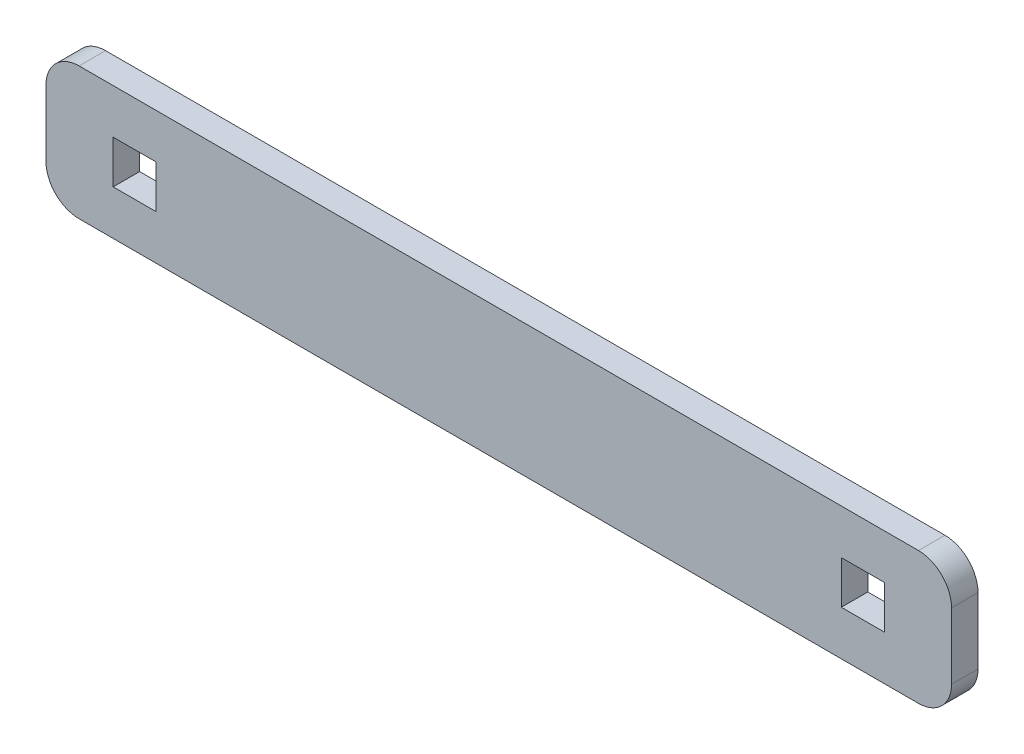
ISO-10303-21;
HEADER;
FILE_DESCRIPTION(('STEP AP214'),'2;1');
FILE_NAME('part.step','',(''),(''),'','','');
FILE_SCHEMA(('AUTOMOTIVE_DESIGN { 1 0 10303 214 1 1 1 1 }'));
ENDSEC;
DATA;
#1=APPLICATION_CONTEXT('core data for automotive mechanical design processes');
#2=APPLICATION_PROTOCOL_DEFINITION('international standard','automotive_design',2000,#1);
#3=PRODUCT_CONTEXT('',#1,'mechanical');
#4=PRODUCT('Part','Part','',(#3));
#5=PRODUCT_RELATED_PRODUCT_CATEGORY('part','',(#4));
#6=PRODUCT_DEFINITION_FORMATION('','',#4);
#7=PRODUCT_DEFINITION_CONTEXT('part definition',#1,'design');
#8=PRODUCT_DEFINITION('design','',#6,#7);
#9=PRODUCT_DEFINITION_SHAPE('','',#8);
#10=(LENGTH_UNIT() NAMED_UNIT(*) SI_UNIT(.MILLI.,.METRE.));
#11=(NAMED_UNIT(*) PLANE_ANGLE_UNIT() SI_UNIT($,.RADIAN.));
#12=(NAMED_UNIT(*) SI_UNIT($,.STERADIAN.) SOLID_ANGLE_UNIT());
#13=UNCERTAINTY_MEASURE_WITH_UNIT(LENGTH_MEASURE(1.E-05),#10,'distance_accuracy_value','');
#14=(GEOMETRIC_REPRESENTATION_CONTEXT(3) GLOBAL_UNCERTAINTY_ASSIGNED_CONTEXT((#13)) GLOBAL_UNIT_ASSIGNED_CONTEXT((#10,
#11,#12)) REPRESENTATION_CONTEXT('',''));
#15=CARTESIAN_POINT('',(0.,0.,0.));
#16=DIRECTION('',(0.,0.,1.));
#17=DIRECTION('',(1.,0.,0.));
#18=AXIS2_PLACEMENT_3D('',#15,#16,#17);
#19=CARTESIAN_POINT('',(-68.4,-10.,-4.));
#20=DIRECTION('',(-1.,0.,0.));
#21=DIRECTION('',(0.,-1.,0.));
#22=AXIS2_PLACEMENT_3D('',#19,#20,#21);
#23=PLANE('',#22);
#24=DIRECTION('',(0.,-1.,0.));
#25=VECTOR('',#24,1.);
#26=CARTESIAN_POINT('',(-68.4,-10.,-4.));
#27=LINE('',#26,#25);
#28=CARTESIAN_POINT('',(-68.4,5.,-4.));
#29=VERTEX_POINT('',#28);
#30=CARTESIAN_POINT('',(-68.4,-5.,-4.));
#31=VERTEX_POINT('',#30);
#32=EDGE_CURVE('E255',#29,#31,#27,.T.);
#33=ORIENTED_EDGE('',*,*,#32,.T.);
#34=DIRECTION('',(0.,0.,1.));
#35=VECTOR('',#34,1.);
#36=CARTESIAN_POINT('',(-68.4,-5.,-4.));
#37=LINE('',#36,#35);
#38=CARTESIAN_POINT('',(-68.4,-5.,0.));
#39=VERTEX_POINT('',#38);
#40=EDGE_CURVE('E288',#31,#39,#37,.T.);
#41=ORIENTED_EDGE('',*,*,#40,.T.);
#42=DIRECTION('',(0.,-1.,0.));
#43=VECTOR('',#42,1.);
#44=CARTESIAN_POINT('',(-68.4,-10.,0.));
#45=LINE('',#44,#43);
#46=CARTESIAN_POINT('',(-68.4,5.,0.));
#47=VERTEX_POINT('',#46);
#48=EDGE_CURVE('E245',#47,#39,#45,.T.);
#49=ORIENTED_EDGE('',*,*,#48,.F.);
#50=DIRECTION('',(0.,0.,1.));
#51=VECTOR('',#50,1.);
#52=CARTESIAN_POINT('',(-68.4,5.,-4.));
#53=LINE('',#52,#51);
#54=EDGE_CURVE('E271',#47,#29,#53,.F.);
#55=ORIENTED_EDGE('',*,*,#54,.T.);
#56=EDGE_LOOP('',(#33,#41,#49,#55));
#57=FACE_BOUND('',#56,.T.);
#58=ADVANCED_FACE('F40',(#57),#23,.T.);
#59=CARTESIAN_POINT('',(68.4,10.,-4.));
#60=DIRECTION('',(0.,1.,0.));
#61=DIRECTION('',(0.,0.,1.));
#62=AXIS2_PLACEMENT_3D('',#59,#60,#61);
#63=PLANE('',#62);
#64=DIRECTION('',(-1.,0.,0.));
#65=VECTOR('',#64,1.);
#66=CARTESIAN_POINT('',(68.4,10.,-4.));
#67=LINE('',#66,#65);
#68=CARTESIAN_POINT('',(63.4,10.,-4.));
#69=VERTEX_POINT('',#68);
#70=CARTESIAN_POINT('',(-63.4,10.,-4.));
#71=VERTEX_POINT('',#70);
#72=EDGE_CURVE('E267',#69,#71,#67,.T.);
#73=ORIENTED_EDGE('',*,*,#72,.T.);
#74=DIRECTION('',(0.,0.,1.));
#75=VECTOR('',#74,1.);
#76=CARTESIAN_POINT('',(-63.4,10.,-4.));
#77=LINE('',#76,#75);
#78=CARTESIAN_POINT('',(-63.4,10.,0.));
#79=VERTEX_POINT('',#78);
#80=EDGE_CURVE('E325',#71,#79,#77,.T.);
#81=ORIENTED_EDGE('',*,*,#80,.T.);
#82=DIRECTION('',(-1.,0.,0.));
#83=VECTOR('',#82,1.);
#84=CARTESIAN_POINT('',(68.4,10.,0.));
#85=LINE('',#84,#83);
#86=CARTESIAN_POINT('',(63.4,10.,0.));
#87=VERTEX_POINT('',#86);
#88=EDGE_CURVE('E260',#87,#79,#85,.T.);
#89=ORIENTED_EDGE('',*,*,#88,.F.);
#90=DIRECTION('',(0.,0.,1.));
#91=VECTOR('',#90,1.);
#92=CARTESIAN_POINT('',(63.4,10.,-4.));
#93=LINE('',#92,#91);
#94=EDGE_CURVE('E322',#87,#69,#93,.F.);
#95=ORIENTED_EDGE('',*,*,#94,.T.);
#96=EDGE_LOOP('',(#73,#81,#89,#95));
#97=FACE_BOUND('',#96,.T.);
#98=ADVANCED_FACE('F359',(#97),#63,.T.);
#99=CARTESIAN_POINT('',(68.4,-10.,-4.));
#100=DIRECTION('',(1.,0.,0.));
#101=DIRECTION('',(0.,1.,0.));
#102=AXIS2_PLACEMENT_3D('',#99,#100,#101);
#103=PLANE('',#102);
#104=DIRECTION('',(0.,1.,0.));
#105=VECTOR('',#104,1.);
#106=CARTESIAN_POINT('',(68.4,-10.,0.));
#107=LINE('',#106,#105);
#108=CARTESIAN_POINT('',(68.4,-5.,0.));
#109=VERTEX_POINT('',#108);
#110=CARTESIAN_POINT('',(68.4,5.,0.));
#111=VERTEX_POINT('',#110);
#112=EDGE_CURVE('E279',#109,#111,#107,.T.);
#113=ORIENTED_EDGE('',*,*,#112,.F.);
#114=DIRECTION('',(0.,0.,1.));
#115=VECTOR('',#114,1.);
#116=CARTESIAN_POINT('',(68.4,-5.,-4.));
#117=LINE('',#116,#115);
#118=CARTESIAN_POINT('',(68.4,-5.,-4.));
#119=VERTEX_POINT('',#118);
#120=EDGE_CURVE('E11',#109,#119,#117,.F.);
#121=ORIENTED_EDGE('',*,*,#120,.T.);
#122=DIRECTION('',(0.,1.,0.));
#123=VECTOR('',#122,1.);
#124=CARTESIAN_POINT('',(68.4,-10.,-4.));
#125=LINE('',#124,#123);
#126=CARTESIAN_POINT('',(68.4,5.,-4.));
#127=VERTEX_POINT('',#126);
#128=EDGE_CURVE('E264',#119,#127,#125,.T.);
#129=ORIENTED_EDGE('',*,*,#128,.T.);
#130=DIRECTION('',(0.,0.,1.));
#131=VECTOR('',#130,1.);
#132=CARTESIAN_POINT('',(68.4,5.,-4.));
#133=LINE('',#132,#131);
#134=EDGE_CURVE('E49',#127,#111,#133,.T.);
#135=ORIENTED_EDGE('',*,*,#134,.T.);
#136=EDGE_LOOP('',(#113,#121,#129,#135));
#137=FACE_BOUND('',#136,.T.);
#138=ADVANCED_FACE('F332',(#137),#103,.T.);
#139=CARTESIAN_POINT('',(68.4,-10.,-4.));
#140=DIRECTION('',(0.,-1.,0.));
#141=DIRECTION('',(0.,0.,-1.));
#142=AXIS2_PLACEMENT_3D('',#139,#140,#141);
#143=PLANE('',#142);
#144=DIRECTION('',(1.,0.,0.));
#145=VECTOR('',#144,1.);
#146=CARTESIAN_POINT('',(68.4,-10.,0.));
#147=LINE('',#146,#145);
#148=CARTESIAN_POINT('',(-63.4,-10.,0.));
#149=VERTEX_POINT('',#148);
#150=CARTESIAN_POINT('',(63.4,-10.,0.));
#151=VERTEX_POINT('',#150);
#152=EDGE_CURVE('E275',#149,#151,#147,.T.);
#153=ORIENTED_EDGE('',*,*,#152,.F.);
#154=DIRECTION('',(0.,0.,1.));
#155=VECTOR('',#154,1.);
#156=CARTESIAN_POINT('',(-63.4,-10.,-4.));
#157=LINE('',#156,#155);
#158=CARTESIAN_POINT('',(-63.4,-10.,-4.));
#159=VERTEX_POINT('',#158);
#160=EDGE_CURVE('E308',#149,#159,#157,.F.);
#161=ORIENTED_EDGE('',*,*,#160,.T.);
#162=DIRECTION('',(1.,0.,0.));
#163=VECTOR('',#162,1.);
#164=CARTESIAN_POINT('',(68.4,-10.,-4.));
#165=LINE('',#164,#163);
#166=CARTESIAN_POINT('',(63.4,-10.,-4.));
#167=VERTEX_POINT('',#166);
#168=EDGE_CURVE('E259',#159,#167,#165,.T.);
#169=ORIENTED_EDGE('',*,*,#168,.T.);
#170=DIRECTION('',(0.,0.,1.));
#171=VECTOR('',#170,1.);
#172=CARTESIAN_POINT('',(63.4,-10.,-4.));
#173=LINE('',#172,#171);
#174=EDGE_CURVE('E304',#167,#151,#173,.T.);
#175=ORIENTED_EDGE('',*,*,#174,.T.);
#176=EDGE_LOOP('',(#153,#161,#169,#175));
#177=FACE_BOUND('',#176,.T.);
#178=ADVANCED_FACE('F343',(#177),#143,.T.);
#179=CARTESIAN_POINT('',(0.,0.,-4.));
#180=DIRECTION('',(0.,0.,1.));
#181=DIRECTION('',(1.,0.,0.));
#182=AXIS2_PLACEMENT_3D('',#179,#180,#181);
#183=PLANE('',#182);
#184=DIRECTION('',(1.,0.,0.));
#185=VECTOR('',#184,1.);
#186=CARTESIAN_POINT('',(58.25,-3.25,-4.));
#187=LINE('',#186,#185);
#188=CARTESIAN_POINT('',(51.75,-3.25,-4.));
#189=VERTEX_POINT('',#188);
#190=CARTESIAN_POINT('',(58.25,-3.25,-4.));
#191=VERTEX_POINT('',#190);
#192=EDGE_CURVE('E167',#189,#191,#187,.T.);
#193=ORIENTED_EDGE('',*,*,#192,.T.);
#194=DIRECTION('',(0.,1.,0.));
#195=VECTOR('',#194,1.);
#196=CARTESIAN_POINT('',(58.25,-3.25,-4.));
#197=LINE('',#196,#195);
#198=CARTESIAN_POINT('',(58.25,3.25,-4.));
#199=VERTEX_POINT('',#198);
#200=EDGE_CURVE('E158',#191,#199,#197,.T.);
#201=ORIENTED_EDGE('',*,*,#200,.T.);
#202=DIRECTION('',(-1.,0.,0.));
#203=VECTOR('',#202,1.);
#204=CARTESIAN_POINT('',(58.25,3.25,-4.));
#205=LINE('',#204,#203);
#206=CARTESIAN_POINT('',(51.75,3.25,-4.));
#207=VERTEX_POINT('',#206);
#208=EDGE_CURVE('E171',#199,#207,#205,.T.);
#209=ORIENTED_EDGE('',*,*,#208,.T.);
#210=DIRECTION('',(0.,-1.,0.));
#211=VECTOR('',#210,1.);
#212=CARTESIAN_POINT('',(51.75,-3.25,-4.));
#213=LINE('',#212,#211);
#214=EDGE_CURVE('E176',#207,#189,#213,.T.);
#215=ORIENTED_EDGE('',*,*,#214,.T.);
#216=EDGE_LOOP('',(#193,#201,#209,#215));
#217=FACE_BOUND('',#216,.T.);
#218=DIRECTION('',(1.,0.,0.));
#219=VECTOR('',#218,1.);
#220=CARTESIAN_POINT('',(-58.25,-3.25,-4.));
#221=LINE('',#220,#219);
#222=CARTESIAN_POINT('',(-58.25,-3.25,-4.));
#223=VERTEX_POINT('',#222);
#224=CARTESIAN_POINT('',(-51.75,-3.25,-4.));
#225=VERTEX_POINT('',#224);
#226=EDGE_CURVE('E224',#223,#225,#221,.T.);
#227=ORIENTED_EDGE('',*,*,#226,.T.);
#228=DIRECTION('',(0.,1.,0.));
#229=VECTOR('',#228,1.);
#230=CARTESIAN_POINT('',(-51.75,-3.25,-4.));
#231=LINE('',#230,#229);
#232=CARTESIAN_POINT('',(-51.75,3.25,-4.));
#233=VERTEX_POINT('',#232);
#234=EDGE_CURVE('E211',#225,#233,#231,.T.);
#235=ORIENTED_EDGE('',*,*,#234,.T.);
#236=DIRECTION('',(-1.,0.,0.));
#237=VECTOR('',#236,1.);
#238=CARTESIAN_POINT('',(-58.25,3.25,-4.));
#239=LINE('',#238,#237);
#240=CARTESIAN_POINT('',(-58.25,3.25,-4.));
#241=VERTEX_POINT('',#240);
#242=EDGE_CURVE('E215',#233,#241,#239,.T.);
#243=ORIENTED_EDGE('',*,*,#242,.T.);
#244=DIRECTION('',(0.,-1.,0.));
#245=VECTOR('',#244,1.);
#246=CARTESIAN_POINT('',(-58.25,-3.25,-4.));
#247=LINE('',#246,#245);
#248=EDGE_CURVE('E220',#241,#223,#247,.T.);
#249=ORIENTED_EDGE('',*,*,#248,.T.);
#250=EDGE_LOOP('',(#227,#235,#243,#249));
#251=FACE_BOUND('',#250,.T.);
#252=ORIENTED_EDGE('',*,*,#168,.F.);
#253=CARTESIAN_POINT('',(-63.4,-5.,-4.));
#254=DIRECTION('',(0.,0.,1.));
#255=DIRECTION('',(1.,0.,0.));
#256=AXIS2_PLACEMENT_3D('',#253,#254,#255);
#257=CIRCLE('',#256,5.);
#258=EDGE_CURVE('E319',#159,#31,#257,.F.);
#259=ORIENTED_EDGE('',*,*,#258,.T.);
#260=ORIENTED_EDGE('',*,*,#32,.F.);
#261=CARTESIAN_POINT('',(-63.4,5.,-4.));
#262=DIRECTION('',(0.,0.,1.));
#263=DIRECTION('',(1.,0.,0.));
#264=AXIS2_PLACEMENT_3D('',#261,#262,#263);
#265=CIRCLE('',#264,5.);
#266=EDGE_CURVE('E316',#29,#71,#265,.F.);
#267=ORIENTED_EDGE('',*,*,#266,.T.);
#268=ORIENTED_EDGE('',*,*,#72,.F.);
#269=CARTESIAN_POINT('',(63.4,5.,-4.));
#270=DIRECTION('',(0.,0.,1.));
#271=DIRECTION('',(1.,0.,0.));
#272=AXIS2_PLACEMENT_3D('',#269,#270,#271);
#273=CIRCLE('',#272,5.);
#274=EDGE_CURVE('E56',#69,#127,#273,.F.);
#275=ORIENTED_EDGE('',*,*,#274,.T.);
#276=ORIENTED_EDGE('',*,*,#128,.F.);
#277=CARTESIAN_POINT('',(63.4,-5.,-4.));
#278=DIRECTION('',(0.,0.,1.));
#279=DIRECTION('',(1.,0.,0.));
#280=AXIS2_PLACEMENT_3D('',#277,#278,#279);
#281=CIRCLE('',#280,5.);
#282=EDGE_CURVE('E313',#119,#167,#281,.F.);
#283=ORIENTED_EDGE('',*,*,#282,.T.);
#284=EDGE_LOOP('',(#252,#259,#260,#267,#268,#275,#276,#283));
#285=FACE_BOUND('',#284,.T.);
#286=ADVANCED_FACE('F178',(#217,#251,#285),#183,.F.);
#287=CARTESIAN_POINT('',(0.,0.,0.));
#288=DIRECTION('',(0.,0.,1.));
#289=DIRECTION('',(1.,0.,0.));
#290=AXIS2_PLACEMENT_3D('',#287,#288,#289);
#291=PLANE('',#290);
#292=DIRECTION('',(0.,1.,0.));
#293=VECTOR('',#292,1.);
#294=CARTESIAN_POINT('',(58.25,-3.25,0.));
#295=LINE('',#294,#293);
#296=CARTESIAN_POINT('',(58.25,-3.25,0.));
#297=VERTEX_POINT('',#296);
#298=CARTESIAN_POINT('',(58.25,3.25,0.));
#299=VERTEX_POINT('',#298);
#300=EDGE_CURVE('E161',#297,#299,#295,.T.);
#301=ORIENTED_EDGE('',*,*,#300,.F.);
#302=DIRECTION('',(1.,0.,0.));
#303=VECTOR('',#302,1.);
#304=CARTESIAN_POINT('',(58.25,-3.25,0.));
#305=LINE('',#304,#303);
#306=CARTESIAN_POINT('',(51.75,-3.25,0.));
#307=VERTEX_POINT('',#306);
#308=EDGE_CURVE('E182',#307,#297,#305,.T.);
#309=ORIENTED_EDGE('',*,*,#308,.F.);
#310=DIRECTION('',(0.,-1.,0.));
#311=VECTOR('',#310,1.);
#312=CARTESIAN_POINT('',(51.75,-3.25,0.));
#313=LINE('',#312,#311);
#314=CARTESIAN_POINT('',(51.75,3.25,0.));
#315=VERTEX_POINT('',#314);
#316=EDGE_CURVE('E187',#315,#307,#313,.T.);
#317=ORIENTED_EDGE('',*,*,#316,.F.);
#318=DIRECTION('',(-1.,0.,0.));
#319=VECTOR('',#318,1.);
#320=CARTESIAN_POINT('',(58.25,3.25,0.));
#321=LINE('',#320,#319);
#322=EDGE_CURVE('E196',#299,#315,#321,.T.);
#323=ORIENTED_EDGE('',*,*,#322,.F.);
#324=EDGE_LOOP('',(#301,#309,#317,#323));
#325=FACE_BOUND('',#324,.T.);
#326=DIRECTION('',(0.,1.,0.));
#327=VECTOR('',#326,1.);
#328=CARTESIAN_POINT('',(-51.75,-3.25,0.));
#329=LINE('',#328,#327);
#330=CARTESIAN_POINT('',(-51.75,-3.25,0.));
#331=VERTEX_POINT('',#330);
#332=CARTESIAN_POINT('',(-51.75,3.25,0.));
#333=VERTEX_POINT('',#332);
#334=EDGE_CURVE('E205',#331,#333,#329,.T.);
#335=ORIENTED_EDGE('',*,*,#334,.F.);
#336=DIRECTION('',(1.,0.,0.));
#337=VECTOR('',#336,1.);
#338=CARTESIAN_POINT('',(-58.25,-3.25,0.));
#339=LINE('',#338,#337);
#340=CARTESIAN_POINT('',(-58.25,-3.25,0.));
#341=VERTEX_POINT('',#340);
#342=EDGE_CURVE('E216',#341,#331,#339,.T.);
#343=ORIENTED_EDGE('',*,*,#342,.F.);
#344=DIRECTION('',(0.,-1.,0.));
#345=VECTOR('',#344,1.);
#346=CARTESIAN_POINT('',(-58.25,-3.25,0.));
#347=LINE('',#346,#345);
#348=CARTESIAN_POINT('',(-58.25,3.25,0.));
#349=VERTEX_POINT('',#348);
#350=EDGE_CURVE('E235',#349,#341,#347,.T.);
#351=ORIENTED_EDGE('',*,*,#350,.F.);
#352=DIRECTION('',(-1.,0.,0.));
#353=VECTOR('',#352,1.);
#354=CARTESIAN_POINT('',(-58.25,3.25,0.));
#355=LINE('',#354,#353);
#356=EDGE_CURVE('E231',#333,#349,#355,.T.);
#357=ORIENTED_EDGE('',*,*,#356,.F.);
#358=EDGE_LOOP('',(#335,#343,#351,#357));
#359=FACE_BOUND('',#358,.T.);
#360=ORIENTED_EDGE('',*,*,#48,.T.);
#361=CARTESIAN_POINT('',(-63.4,-5.,0.));
#362=DIRECTION('',(0.,0.,1.));
#363=DIRECTION('',(1.,0.,0.));
#364=AXIS2_PLACEMENT_3D('',#361,#362,#363);
#365=CIRCLE('',#364,5.);
#366=EDGE_CURVE('E301',#39,#149,#365,.T.);
#367=ORIENTED_EDGE('',*,*,#366,.T.);
#368=ORIENTED_EDGE('',*,*,#152,.T.);
#369=CARTESIAN_POINT('',(63.4,-5.,0.));
#370=DIRECTION('',(0.,0.,1.));
#371=DIRECTION('',(1.,0.,0.));
#372=AXIS2_PLACEMENT_3D('',#369,#370,#371);
#373=CIRCLE('',#372,5.);
#374=EDGE_CURVE('E295',#151,#109,#373,.T.);
#375=ORIENTED_EDGE('',*,*,#374,.T.);
#376=ORIENTED_EDGE('',*,*,#112,.T.);
#377=CARTESIAN_POINT('',(63.4,5.,0.));
#378=DIRECTION('',(0.,0.,1.));
#379=DIRECTION('',(1.,0.,0.));
#380=AXIS2_PLACEMENT_3D('',#377,#378,#379);
#381=CIRCLE('',#380,5.);
#382=EDGE_CURVE('E292',#111,#87,#381,.T.);
#383=ORIENTED_EDGE('',*,*,#382,.T.);
#384=ORIENTED_EDGE('',*,*,#88,.T.);
#385=CARTESIAN_POINT('',(-63.4,5.,0.));
#386=DIRECTION('',(0.,0.,1.));
#387=DIRECTION('',(1.,0.,0.));
#388=AXIS2_PLACEMENT_3D('',#385,#386,#387);
#389=CIRCLE('',#388,5.);
#390=EDGE_CURVE('E298',#79,#47,#389,.T.);
#391=ORIENTED_EDGE('',*,*,#390,.T.);
#392=EDGE_LOOP('',(#360,#367,#368,#375,#376,#383,#384,#391));
#393=FACE_BOUND('',#392,.T.);
#394=ADVANCED_FACE('F335',(#325,#359,#393),#291,.T.);
#395=CARTESIAN_POINT('',(-51.75,-3.25,-4.));
#396=DIRECTION('',(1.,0.,0.));
#397=DIRECTION('',(0.,0.,-1.));
#398=AXIS2_PLACEMENT_3D('',#395,#396,#397);
#399=PLANE('',#398);
#400=ORIENTED_EDGE('',*,*,#334,.T.);
#401=DIRECTION('',(0.,0.,1.));
#402=VECTOR('',#401,1.);
#403=CARTESIAN_POINT('',(-51.75,3.25,-4.));
#404=LINE('',#403,#402);
#405=EDGE_CURVE('E228',#233,#333,#404,.T.);
#406=ORIENTED_EDGE('',*,*,#405,.F.);
#407=ORIENTED_EDGE('',*,*,#234,.F.);
#408=DIRECTION('',(0.,0.,1.));
#409=VECTOR('',#408,1.);
#410=CARTESIAN_POINT('',(-51.75,-3.25,-4.));
#411=LINE('',#410,#409);
#412=EDGE_CURVE('E242',#225,#331,#411,.T.);
#413=ORIENTED_EDGE('',*,*,#412,.T.);
#414=EDGE_LOOP('',(#400,#406,#407,#413));
#415=FACE_BOUND('',#414,.T.);
#416=ADVANCED_FACE('F487',(#415),#399,.F.);
#417=CARTESIAN_POINT('',(-58.25,-3.25,-4.));
#418=DIRECTION('',(0.,-1.,0.));
#419=DIRECTION('',(0.,0.,-1.));
#420=AXIS2_PLACEMENT_3D('',#417,#418,#419);
#421=PLANE('',#420);
#422=ORIENTED_EDGE('',*,*,#342,.T.);
#423=ORIENTED_EDGE('',*,*,#412,.F.);
#424=ORIENTED_EDGE('',*,*,#226,.F.);
#425=DIRECTION('',(0.,0.,1.));
#426=VECTOR('',#425,1.);
#427=CARTESIAN_POINT('',(-58.25,-3.25,-4.));
#428=LINE('',#427,#426);
#429=EDGE_CURVE('E246',#223,#341,#428,.T.);
#430=ORIENTED_EDGE('',*,*,#429,.T.);
#431=EDGE_LOOP('',(#422,#423,#424,#430));
#432=FACE_BOUND('',#431,.T.);
#433=ADVANCED_FACE('F476',(#432),#421,.F.);
#434=CARTESIAN_POINT('',(-58.25,-3.25,-4.));
#435=DIRECTION('',(-1.,0.,0.));
#436=DIRECTION('',(0.,0.,1.));
#437=AXIS2_PLACEMENT_3D('',#434,#435,#436);
#438=PLANE('',#437);
#439=ORIENTED_EDGE('',*,*,#350,.T.);
#440=ORIENTED_EDGE('',*,*,#429,.F.);
#441=ORIENTED_EDGE('',*,*,#248,.F.);
#442=DIRECTION('',(0.,0.,1.));
#443=VECTOR('',#442,1.);
#444=CARTESIAN_POINT('',(-58.25,3.25,-4.));
#445=LINE('',#444,#443);
#446=EDGE_CURVE('E249',#241,#349,#445,.T.);
#447=ORIENTED_EDGE('',*,*,#446,.T.);
#448=EDGE_LOOP('',(#439,#440,#441,#447));
#449=FACE_BOUND('',#448,.T.);
#450=ADVANCED_FACE('F465',(#449),#438,.F.);
#451=CARTESIAN_POINT('',(-58.25,3.25,-4.));
#452=DIRECTION('',(0.,1.,0.));
#453=DIRECTION('',(0.,0.,1.));
#454=AXIS2_PLACEMENT_3D('',#451,#452,#453);
#455=PLANE('',#454);
#456=ORIENTED_EDGE('',*,*,#356,.T.);
#457=ORIENTED_EDGE('',*,*,#446,.F.);
#458=ORIENTED_EDGE('',*,*,#242,.F.);
#459=ORIENTED_EDGE('',*,*,#405,.T.);
#460=EDGE_LOOP('',(#456,#457,#458,#459));
#461=FACE_BOUND('',#460,.T.);
#462=ADVANCED_FACE('F455',(#461),#455,.F.);
#463=CARTESIAN_POINT('',(58.25,-3.25,-4.));
#464=DIRECTION('',(1.,0.,0.));
#465=DIRECTION('',(0.,0.,-1.));
#466=AXIS2_PLACEMENT_3D('',#463,#464,#465);
#467=PLANE('',#466);
#468=ORIENTED_EDGE('',*,*,#300,.T.);
#469=DIRECTION('',(0.,0.,1.));
#470=VECTOR('',#469,1.);
#471=CARTESIAN_POINT('',(58.25,3.25,-4.));
#472=LINE('',#471,#470);
#473=EDGE_CURVE('E154',#199,#299,#472,.T.);
#474=ORIENTED_EDGE('',*,*,#473,.F.);
#475=ORIENTED_EDGE('',*,*,#200,.F.);
#476=DIRECTION('',(0.,0.,1.));
#477=VECTOR('',#476,1.);
#478=CARTESIAN_POINT('',(58.25,-3.25,-4.));
#479=LINE('',#478,#477);
#480=EDGE_CURVE('E202',#191,#297,#479,.T.);
#481=ORIENTED_EDGE('',*,*,#480,.T.);
#482=EDGE_LOOP('',(#468,#474,#475,#481));
#483=FACE_BOUND('',#482,.T.);
#484=ADVANCED_FACE('F156',(#483),#467,.F.);
#485=CARTESIAN_POINT('',(58.25,-3.25,-4.));
#486=DIRECTION('',(0.,-1.,0.));
#487=DIRECTION('',(0.,0.,-1.));
#488=AXIS2_PLACEMENT_3D('',#485,#486,#487);
#489=PLANE('',#488);
#490=ORIENTED_EDGE('',*,*,#308,.T.);
#491=ORIENTED_EDGE('',*,*,#480,.F.);
#492=ORIENTED_EDGE('',*,*,#192,.F.);
#493=DIRECTION('',(0.,0.,1.));
#494=VECTOR('',#493,1.);
#495=CARTESIAN_POINT('',(51.75,-3.25,-4.));
#496=LINE('',#495,#494);
#497=EDGE_CURVE('E206',#189,#307,#496,.T.);
#498=ORIENTED_EDGE('',*,*,#497,.T.);
#499=EDGE_LOOP('',(#490,#491,#492,#498));
#500=FACE_BOUND('',#499,.T.);
#501=ADVANCED_FACE('F434',(#500),#489,.F.);
#502=CARTESIAN_POINT('',(51.75,-3.25,-4.));
#503=DIRECTION('',(-1.,0.,0.));
#504=DIRECTION('',(0.,0.,1.));
#505=AXIS2_PLACEMENT_3D('',#502,#503,#504);
#506=PLANE('',#505);
#507=ORIENTED_EDGE('',*,*,#316,.T.);
#508=ORIENTED_EDGE('',*,*,#497,.F.);
#509=ORIENTED_EDGE('',*,*,#214,.F.);
#510=DIRECTION('',(0.,0.,1.));
#511=VECTOR('',#510,1.);
#512=CARTESIAN_POINT('',(51.75,3.25,-4.));
#513=LINE('',#512,#511);
#514=EDGE_CURVE('E166',#207,#315,#513,.T.);
#515=ORIENTED_EDGE('',*,*,#514,.T.);
#516=EDGE_LOOP('',(#507,#508,#509,#515));
#517=FACE_BOUND('',#516,.T.);
#518=ADVANCED_FACE('F424',(#517),#506,.F.);
#519=CARTESIAN_POINT('',(58.25,3.25,-4.));
#520=DIRECTION('',(0.,1.,0.));
#521=DIRECTION('',(0.,0.,1.));
#522=AXIS2_PLACEMENT_3D('',#519,#520,#521);
#523=PLANE('',#522);
#524=ORIENTED_EDGE('',*,*,#322,.T.);
#525=ORIENTED_EDGE('',*,*,#514,.F.);
#526=ORIENTED_EDGE('',*,*,#208,.F.);
#527=ORIENTED_EDGE('',*,*,#473,.T.);
#528=EDGE_LOOP('',(#524,#525,#526,#527));
#529=FACE_BOUND('',#528,.T.);
#530=ADVANCED_FACE('F172',(#529),#523,.F.);
#531=CARTESIAN_POINT('',(-63.4,-5.,-4.));
#532=DIRECTION('',(0.,0.,1.));
#533=DIRECTION('',(1.,0.,0.));
#534=AXIS2_PLACEMENT_3D('',#531,#532,#533);
#535=CYLINDRICAL_SURFACE('',#534,5.);
#536=ORIENTED_EDGE('',*,*,#258,.F.);
#537=ORIENTED_EDGE('',*,*,#160,.F.);
#538=ORIENTED_EDGE('',*,*,#366,.F.);
#539=ORIENTED_EDGE('',*,*,#40,.F.);
#540=EDGE_LOOP('',(#536,#537,#538,#539));
#541=FACE_BOUND('',#540,.T.);
#542=ADVANCED_FACE('F350',(#541),#535,.T.);
#543=CARTESIAN_POINT('',(-63.4,5.,-4.));
#544=DIRECTION('',(0.,0.,1.));
#545=DIRECTION('',(1.,0.,0.));
#546=AXIS2_PLACEMENT_3D('',#543,#544,#545);
#547=CYLINDRICAL_SURFACE('',#546,5.);
#548=ORIENTED_EDGE('',*,*,#266,.F.);
#549=ORIENTED_EDGE('',*,*,#54,.F.);
#550=ORIENTED_EDGE('',*,*,#390,.F.);
#551=ORIENTED_EDGE('',*,*,#80,.F.);
#552=EDGE_LOOP('',(#548,#549,#550,#551));
#553=FACE_BOUND('',#552,.T.);
#554=ADVANCED_FACE('F357',(#553),#547,.T.);
#555=CARTESIAN_POINT('',(63.4,-5.,-4.));
#556=DIRECTION('',(0.,0.,1.));
#557=DIRECTION('',(1.,0.,0.));
#558=AXIS2_PLACEMENT_3D('',#555,#556,#557);
#559=CYLINDRICAL_SURFACE('',#558,5.);
#560=ORIENTED_EDGE('',*,*,#282,.F.);
#561=ORIENTED_EDGE('',*,*,#120,.F.);
#562=ORIENTED_EDGE('',*,*,#374,.F.);
#563=ORIENTED_EDGE('',*,*,#174,.F.);
#564=EDGE_LOOP('',(#560,#561,#562,#563));
#565=FACE_BOUND('',#564,.T.);
#566=ADVANCED_FACE('F341',(#565),#559,.T.);
#567=CARTESIAN_POINT('',(63.4,5.,-4.));
#568=DIRECTION('',(0.,0.,1.));
#569=DIRECTION('',(1.,0.,0.));
#570=AXIS2_PLACEMENT_3D('',#567,#568,#569);
#571=CYLINDRICAL_SURFACE('',#570,5.);
#572=ORIENTED_EDGE('',*,*,#274,.F.);
#573=ORIENTED_EDGE('',*,*,#94,.F.);
#574=ORIENTED_EDGE('',*,*,#382,.F.);
#575=ORIENTED_EDGE('',*,*,#134,.F.);
#576=EDGE_LOOP('',(#572,#573,#574,#575));
#577=FACE_BOUND('',#576,.T.);
#578=ADVANCED_FACE('F42',(#577),#571,.T.);
#579=CLOSED_SHELL('',(#58,#98,#138,#178,#286,#394,#416,#433,#450,#462,#484,#501,#518,#530,#542,
#554,#566,#578));
#580=MANIFOLD_SOLID_BREP('B2',#579);
#581=ADVANCED_BREP_SHAPE_REPRESENTATION('',(#18,#580),#14);
#582=SHAPE_DEFINITION_REPRESENTATION(#9,#581);
ENDSEC;
END-ISO-10303-21;
